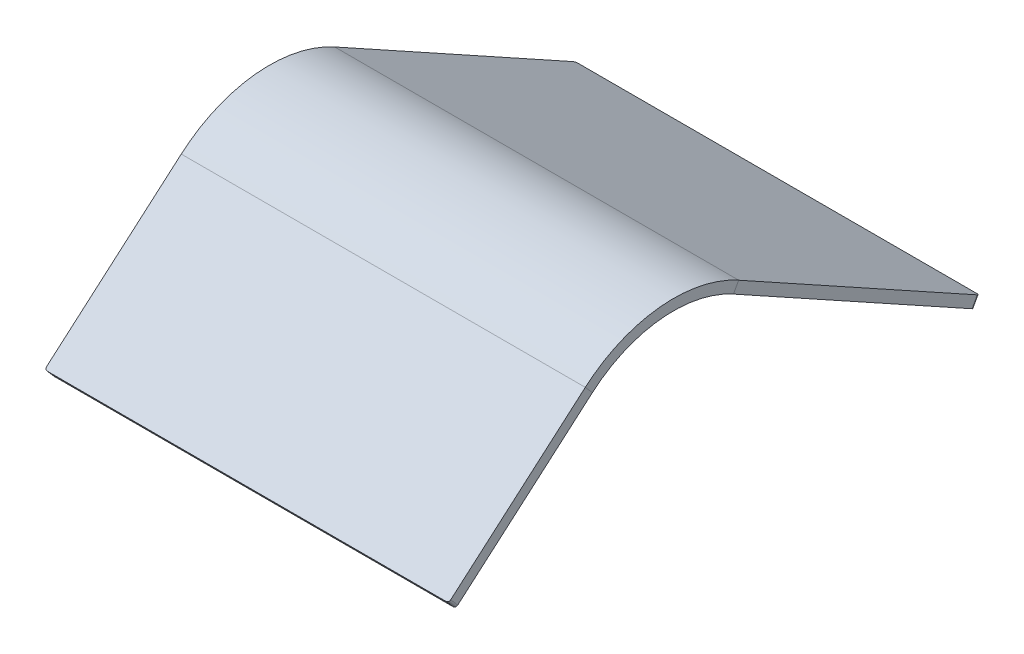
ISO-10303-21;
HEADER;
FILE_DESCRIPTION(('STEP AP214'),'2;1');
FILE_NAME('part.step','',(''),(''),'','','');
FILE_SCHEMA(('AUTOMOTIVE_DESIGN { 1 0 10303 214 1 1 1 1 }'));
ENDSEC;
DATA;
#1=APPLICATION_CONTEXT('core data for automotive mechanical design processes');
#2=APPLICATION_PROTOCOL_DEFINITION('international standard','automotive_design',2000,#1);
#3=PRODUCT_CONTEXT('',#1,'mechanical');
#4=PRODUCT('Part','Part','',(#3));
#5=PRODUCT_RELATED_PRODUCT_CATEGORY('part','',(#4));
#6=PRODUCT_DEFINITION_FORMATION('','',#4);
#7=PRODUCT_DEFINITION_CONTEXT('part definition',#1,'design');
#8=PRODUCT_DEFINITION('design','',#6,#7);
#9=PRODUCT_DEFINITION_SHAPE('','',#8);
#10=(LENGTH_UNIT() NAMED_UNIT(*) SI_UNIT(.MILLI.,.METRE.));
#11=(NAMED_UNIT(*) PLANE_ANGLE_UNIT() SI_UNIT($,.RADIAN.));
#12=(NAMED_UNIT(*) SI_UNIT($,.STERADIAN.) SOLID_ANGLE_UNIT());
#13=UNCERTAINTY_MEASURE_WITH_UNIT(LENGTH_MEASURE(1.E-05),#10,'distance_accuracy_value','');
#14=(GEOMETRIC_REPRESENTATION_CONTEXT(3) GLOBAL_UNCERTAINTY_ASSIGNED_CONTEXT((#13)) GLOBAL_UNIT_ASSIGNED_CONTEXT((#10,
#11,#12)) REPRESENTATION_CONTEXT('',''));
#15=CARTESIAN_POINT('',(0.,0.,0.));
#16=DIRECTION('',(0.,0.,1.));
#17=DIRECTION('',(1.,0.,0.));
#18=AXIS2_PLACEMENT_3D('',#15,#16,#17);
#19=CARTESIAN_POINT('',(150.,87.9153729006915,283.559185114587));
#20=DIRECTION('',(1.,0.,0.));
#21=DIRECTION('',(0.,0.,-1.));
#22=AXIS2_PLACEMENT_3D('',#19,#20,#21);
#23=PLANE('',#22);
#24=DIRECTION('',(0.,0.755689082789819,0.65493053841784));
#25=VECTOR('',#24,1.);
#26=CARTESIAN_POINT('',(150.,87.9153729006915,283.559185114587));
#27=LINE('',#26,#25);
#28=CARTESIAN_POINT('',(150.,87.9153729006915,283.559185114587));
#29=VERTEX_POINT('',#28);
#30=CARTESIAN_POINT('',(150.,93.96088556301,288.798629421929));
#31=VERTEX_POINT('',#30);
#32=EDGE_CURVE('E150',#29,#31,#27,.T.);
#33=ORIENTED_EDGE('',*,*,#32,.F.);
#34=CARTESIAN_POINT('',(150.,18.3919772840282,223.305575580145));
#35=DIRECTION('',(-1.,0.,0.));
#36=DIRECTION('',(0.,0.,1.));
#37=AXIS2_PLACEMENT_3D('',#34,#35,#36);
#38=CIRCLE('',#37,92.);
#39=CARTESIAN_POINT('',(150.,98.8951091864612,178.771928144757));
#40=VERTEX_POINT('',#39);
#41=EDGE_CURVE('E145',#29,#40,#38,.T.);
#42=ORIENTED_EDGE('',*,*,#41,.T.);
#43=DIRECTION('',(0.,-0.875034042417748,0.484061385167269));
#44=VECTOR('',#43,1.);
#45=CARTESIAN_POINT('',(150.,105.895381525803,174.899437063419));
#46=LINE('',#45,#44);
#47=CARTESIAN_POINT('',(150.,105.895381525803,174.899437063419));
#48=VERTEX_POINT('',#47);
#49=EDGE_CURVE('E139',#48,#40,#46,.T.);
#50=ORIENTED_EDGE('',*,*,#49,.F.);
#51=CARTESIAN_POINT('',(150.,18.3919772840282,223.305575580145));
#52=DIRECTION('',(1.,0.,0.));
#53=DIRECTION('',(0.,0.,-1.));
#54=AXIS2_PLACEMENT_3D('',#51,#52,#53);
#55=CIRCLE('',#54,100.);
#56=EDGE_CURVE('E143',#31,#48,#55,.F.);
#57=ORIENTED_EDGE('',*,*,#56,.F.);
#58=EDGE_LOOP('',(#33,#42,#50,#57));
#59=FACE_BOUND('',#58,.T.);
#60=ADVANCED_FACE('F49',(#59),#23,.T.);
#61=CARTESIAN_POINT('',(150.,105.895381525803,174.899437063419));
#62=DIRECTION('',(1.,0.,0.));
#63=DIRECTION('',(0.,0.,-1.));
#64=AXIS2_PLACEMENT_3D('',#61,#62,#63);
#65=PLANE('',#64);
#66=DIRECTION('',(0.,0.654930538417842,-0.755689082789818));
#67=VECTOR('',#66,1.);
#68=CARTESIAN_POINT('',(150.,6.04551266231849,390.239444307343));
#69=LINE('',#68,#67);
#70=CARTESIAN_POINT('',(150.,7.35537373915416,388.728066141763));
#71=VERTEX_POINT('',#70);
#72=EDGE_CURVE('E178',#71,#31,#69,.T.);
#73=ORIENTED_EDGE('',*,*,#72,.F.);
#74=DIRECTION('',(0.,0.755689082789817,0.654930538417843));
#75=VECTOR('',#74,1.);
#76=CARTESIAN_POINT('',(150.,-42.2006692006457,345.779495593936));
#77=LINE('',#76,#75);
#78=CARTESIAN_POINT('',(150.,1.30986107683562,383.48862183442));
#79=VERTEX_POINT('',#78);
#80=EDGE_CURVE('E13',#71,#79,#77,.F.);
#81=ORIENTED_EDGE('',*,*,#80,.T.);
#82=DIRECTION('',(0.,0.654930538417842,-0.755689082789818));
#83=VECTOR('',#82,1.);
#84=CARTESIAN_POINT('',(150.,0.,385.));
#85=LINE('',#84,#83);
#86=EDGE_CURVE('E180',#79,#29,#85,.T.);
#87=ORIENTED_EDGE('',*,*,#86,.T.);
#88=ORIENTED_EDGE('',*,*,#32,.T.);
#89=EDGE_LOOP('',(#73,#81,#87,#88));
#90=FACE_BOUND('',#89,.T.);
#91=ADVANCED_FACE('F268',(#90),#65,.T.);
#92=CARTESIAN_POINT('',(-150.,98.8951091864612,178.771928144757));
#93=DIRECTION('',(-1.,0.,0.));
#94=DIRECTION('',(0.,0.,1.));
#95=AXIS2_PLACEMENT_3D('',#92,#93,#94);
#96=PLANE('',#95);
#97=DIRECTION('',(0.,0.875034042417748,-0.484061385167269));
#98=VECTOR('',#97,1.);
#99=CARTESIAN_POINT('',(-150.,98.8951091864612,178.771928144757));
#100=LINE('',#99,#98);
#101=CARTESIAN_POINT('',(-150.,98.8951091864612,178.771928144757));
#102=VERTEX_POINT('',#101);
#103=CARTESIAN_POINT('',(-150.,105.895381525803,174.899437063419));
#104=VERTEX_POINT('',#103);
#105=EDGE_CURVE('E151',#102,#104,#100,.T.);
#106=ORIENTED_EDGE('',*,*,#105,.F.);
#107=CARTESIAN_POINT('',(-150.,18.3919772840282,223.305575580145));
#108=DIRECTION('',(-1.,0.,0.));
#109=DIRECTION('',(0.,0.,1.));
#110=AXIS2_PLACEMENT_3D('',#107,#108,#109);
#111=CIRCLE('',#110,92.);
#112=CARTESIAN_POINT('',(-150.,87.9153729006915,283.559185114587));
#113=VERTEX_POINT('',#112);
#114=EDGE_CURVE('E197',#113,#102,#111,.T.);
#115=ORIENTED_EDGE('',*,*,#114,.F.);
#116=DIRECTION('',(0.,-0.755689082789819,-0.65493053841784));
#117=VECTOR('',#116,1.);
#118=CARTESIAN_POINT('',(-150.,93.96088556301,288.798629421929));
#119=LINE('',#118,#117);
#120=CARTESIAN_POINT('',(-150.,93.96088556301,288.798629421929));
#121=VERTEX_POINT('',#120);
#122=EDGE_CURVE('E214',#121,#113,#119,.T.);
#123=ORIENTED_EDGE('',*,*,#122,.F.);
#124=CARTESIAN_POINT('',(-150.,18.3919772840282,223.305575580145));
#125=DIRECTION('',(1.,0.,0.));
#126=DIRECTION('',(0.,0.,-1.));
#127=AXIS2_PLACEMENT_3D('',#124,#125,#126);
#128=CIRCLE('',#127,100.);
#129=EDGE_CURVE('E191',#121,#104,#128,.F.);
#130=ORIENTED_EDGE('',*,*,#129,.T.);
#131=EDGE_LOOP('',(#106,#115,#123,#130));
#132=FACE_BOUND('',#131,.T.);
#133=ADVANCED_FACE('F291',(#132),#96,.T.);
#134=CARTESIAN_POINT('',(-150.,93.96088556301,288.798629421929));
#135=DIRECTION('',(-1.,0.,0.));
#136=DIRECTION('',(0.,0.,1.));
#137=AXIS2_PLACEMENT_3D('',#134,#135,#136);
#138=PLANE('',#137);
#139=DIRECTION('',(0.,-0.484061385167266,-0.87503404241775));
#140=VECTOR('',#139,1.);
#141=CARTESIAN_POINT('',(-150.,137.000272339342,231.127508918662));
#142=LINE('',#141,#140);
#143=CARTESIAN_POINT('',(-150.,7.96839510967642,-2.12242299650284));
#144=VERTEX_POINT('',#143);
#145=EDGE_CURVE('E163',#104,#144,#142,.T.);
#146=ORIENTED_EDGE('',*,*,#145,.T.);
#147=DIRECTION('',(0.,-0.875034042417742,0.48406138516728));
#148=VECTOR('',#147,1.);
#149=CARTESIAN_POINT('',(-150.,-49.4139669852702,29.6210113538945));
#150=LINE('',#149,#148);
#151=CARTESIAN_POINT('',(-150.,0.968122770334534,1.75006808483549));
#152=VERTEX_POINT('',#151);
#153=EDGE_CURVE('E220',#144,#152,#150,.T.);
#154=ORIENTED_EDGE('',*,*,#153,.T.);
#155=DIRECTION('',(0.,-0.484061385167266,-0.87503404241775));
#156=VECTOR('',#155,1.);
#157=CARTESIAN_POINT('',(-150.,130.,235.));
#158=LINE('',#157,#156);
#159=EDGE_CURVE('E187',#102,#152,#158,.T.);
#160=ORIENTED_EDGE('',*,*,#159,.F.);
#161=ORIENTED_EDGE('',*,*,#105,.T.);
#162=EDGE_LOOP('',(#146,#154,#160,#161));
#163=FACE_BOUND('',#162,.T.);
#164=ADVANCED_FACE('F289',(#163),#138,.T.);
#165=CARTESIAN_POINT('',(150.,130.,235.));
#166=DIRECTION('',(0.,0.87503404241775,-0.484061385167266));
#167=DIRECTION('',(0.,0.484061385167266,0.87503404241775));
#168=AXIS2_PLACEMENT_3D('',#165,#166,#167);
#169=PLANE('',#168);
#170=ORIENTED_EDGE('',*,*,#159,.T.);
#171=CARTESIAN_POINT('',(-148.,0.968122770334506,1.75006808483549));
#172=DIRECTION('',(0.,0.87503404241775,-0.484061385167266));
#173=DIRECTION('',(0.,0.484061385167266,0.87503404241775));
#174=AXIS2_PLACEMENT_3D('',#171,#172,#173);
#175=CIRCLE('',#174,2.);
#176=CARTESIAN_POINT('',(-148.,0.,0.));
#177=VERTEX_POINT('',#176);
#178=EDGE_CURVE('E225',#152,#177,#175,.F.);
#179=ORIENTED_EDGE('',*,*,#178,.T.);
#180=DIRECTION('',(-1.,0.,0.));
#181=VECTOR('',#180,1.);
#182=CARTESIAN_POINT('',(150.,0.,0.));
#183=LINE('',#182,#181);
#184=CARTESIAN_POINT('',(148.,0.,0.));
#185=VERTEX_POINT('',#184);
#186=EDGE_CURVE('E211',#185,#177,#183,.T.);
#187=ORIENTED_EDGE('',*,*,#186,.F.);
#188=CARTESIAN_POINT('',(148.,0.96812277033453,1.7500680848355));
#189=DIRECTION('',(0.,0.87503404241775,-0.484061385167266));
#190=DIRECTION('',(0.,0.484061385167266,0.87503404241775));
#191=AXIS2_PLACEMENT_3D('',#188,#189,#190);
#192=CIRCLE('',#191,2.);
#193=CARTESIAN_POINT('',(150.,0.968122770334562,1.75006808483555));
#194=VERTEX_POINT('',#193);
#195=EDGE_CURVE('E223',#185,#194,#192,.F.);
#196=ORIENTED_EDGE('',*,*,#195,.T.);
#197=DIRECTION('',(0.,-0.484061385167266,-0.87503404241775));
#198=VECTOR('',#197,1.);
#199=CARTESIAN_POINT('',(150.,130.,235.));
#200=LINE('',#199,#198);
#201=EDGE_CURVE('E173',#40,#194,#200,.T.);
#202=ORIENTED_EDGE('',*,*,#201,.F.);
#203=DIRECTION('',(-1.,0.,0.));
#204=VECTOR('',#203,1.);
#205=CARTESIAN_POINT('',(150.,98.8951091864612,178.771928144757));
#206=LINE('',#205,#204);
#207=EDGE_CURVE('E186',#40,#102,#206,.T.);
#208=ORIENTED_EDGE('',*,*,#207,.T.);
#209=EDGE_LOOP('',(#170,#179,#187,#196,#202,#208));
#210=FACE_BOUND('',#209,.T.);
#211=ADVANCED_FACE('F275',(#210),#169,.F.);
#212=CARTESIAN_POINT('',(150.,7.00027233934195,-3.87249108133825));
#213=DIRECTION('',(0.,-0.48406138516728,-0.875034042417742));
#214=DIRECTION('',(0.,0.875034042417742,-0.48406138516728));
#215=AXIS2_PLACEMENT_3D('',#212,#213,#214);
#216=PLANE('',#215);
#217=ORIENTED_EDGE('',*,*,#186,.T.);
#218=DIRECTION('',(0.,-0.875034042417742,0.48406138516728));
#219=VECTOR('',#218,1.);
#220=CARTESIAN_POINT('',(-148.,7.00027233934195,-3.87249108133825));
#221=LINE('',#220,#219);
#222=CARTESIAN_POINT('',(-148.,7.00027233934195,-3.87249108133825));
#223=VERTEX_POINT('',#222);
#224=EDGE_CURVE('E230',#177,#223,#221,.F.);
#225=ORIENTED_EDGE('',*,*,#224,.T.);
#226=DIRECTION('',(-1.,0.,0.));
#227=VECTOR('',#226,1.);
#228=CARTESIAN_POINT('',(150.,7.00027233934195,-3.87249108133825));
#229=LINE('',#228,#227);
#230=CARTESIAN_POINT('',(148.,7.00027233934195,-3.87249108133825));
#231=VERTEX_POINT('',#230);
#232=EDGE_CURVE('E167',#231,#223,#229,.T.);
#233=ORIENTED_EDGE('',*,*,#232,.F.);
#234=DIRECTION('',(0.,-0.875034042417742,0.48406138516728));
#235=VECTOR('',#234,1.);
#236=CARTESIAN_POINT('',(148.,7.00027233934195,-3.87249108133825));
#237=LINE('',#236,#235);
#238=EDGE_CURVE('E227',#231,#185,#237,.T.);
#239=ORIENTED_EDGE('',*,*,#238,.T.);
#240=EDGE_LOOP('',(#217,#225,#233,#239));
#241=FACE_BOUND('',#240,.T.);
#242=ADVANCED_FACE('F283',(#241),#216,.T.);
#243=CARTESIAN_POINT('',(150.,137.000272339342,231.127508918662));
#244=DIRECTION('',(0.,0.87503404241775,-0.484061385167266));
#245=DIRECTION('',(0.,0.484061385167266,0.87503404241775));
#246=AXIS2_PLACEMENT_3D('',#243,#244,#245);
#247=PLANE('',#246);
#248=ORIENTED_EDGE('',*,*,#232,.T.);
#249=CARTESIAN_POINT('',(-148.,7.96839510967648,-2.12242299650277));
#250=DIRECTION('',(0.,0.87503404241775,-0.484061385167266));
#251=DIRECTION('',(0.,0.484061385167266,0.87503404241775));
#252=AXIS2_PLACEMENT_3D('',#249,#250,#251);
#253=CIRCLE('',#252,2.);
#254=EDGE_CURVE('E234',#223,#144,#253,.T.);
#255=ORIENTED_EDGE('',*,*,#254,.T.);
#256=ORIENTED_EDGE('',*,*,#145,.F.);
#257=DIRECTION('',(-1.,0.,0.));
#258=VECTOR('',#257,1.);
#259=CARTESIAN_POINT('',(150.,105.895381525803,174.899437063419));
#260=LINE('',#259,#258);
#261=EDGE_CURVE('E157',#48,#104,#260,.T.);
#262=ORIENTED_EDGE('',*,*,#261,.F.);
#263=DIRECTION('',(0.,-0.484061385167266,-0.87503404241775));
#264=VECTOR('',#263,1.);
#265=CARTESIAN_POINT('',(150.,137.000272339342,231.127508918662));
#266=LINE('',#265,#264);
#267=CARTESIAN_POINT('',(150.,7.96839510967642,-2.12242299650284));
#268=VERTEX_POINT('',#267);
#269=EDGE_CURVE('E160',#48,#268,#266,.T.);
#270=ORIENTED_EDGE('',*,*,#269,.T.);
#271=CARTESIAN_POINT('',(148.,7.96839510967648,-2.12242299650275));
#272=DIRECTION('',(0.,0.87503404241775,-0.484061385167266));
#273=DIRECTION('',(0.,0.484061385167266,0.87503404241775));
#274=AXIS2_PLACEMENT_3D('',#271,#272,#273);
#275=CIRCLE('',#274,2.);
#276=EDGE_CURVE('E232',#268,#231,#275,.T.);
#277=ORIENTED_EDGE('',*,*,#276,.T.);
#278=EDGE_LOOP('',(#248,#255,#256,#262,#270,#277));
#279=FACE_BOUND('',#278,.T.);
#280=ADVANCED_FACE('F159',(#279),#247,.T.);
#281=CARTESIAN_POINT('',(150.,18.3919772840282,223.305575580145));
#282=DIRECTION('',(-1.,0.,0.));
#283=DIRECTION('',(0.,0.,1.));
#284=AXIS2_PLACEMENT_3D('',#281,#282,#283);
#285=CYLINDRICAL_SURFACE('',#284,100.);
#286=ORIENTED_EDGE('',*,*,#129,.F.);
#287=DIRECTION('',(-1.,0.,0.));
#288=VECTOR('',#287,1.);
#289=CARTESIAN_POINT('',(150.,93.96088556301,288.798629421929));
#290=LINE('',#289,#288);
#291=EDGE_CURVE('E168',#31,#121,#290,.T.);
#292=ORIENTED_EDGE('',*,*,#291,.F.);
#293=ORIENTED_EDGE('',*,*,#56,.T.);
#294=ORIENTED_EDGE('',*,*,#261,.T.);
#295=EDGE_LOOP('',(#286,#292,#293,#294));
#296=FACE_BOUND('',#295,.T.);
#297=ADVANCED_FACE('F176',(#296),#285,.T.);
#298=CARTESIAN_POINT('',(150.,6.04551266231849,390.239444307343));
#299=DIRECTION('',(0.,0.755689082789817,0.654930538417842));
#300=DIRECTION('',(0.,-0.654930538417842,0.755689082789817));
#301=AXIS2_PLACEMENT_3D('',#298,#299,#300);
#302=PLANE('',#301);
#303=DIRECTION('',(0.,0.654930538417842,-0.755689082789818));
#304=VECTOR('',#303,1.);
#305=CARTESIAN_POINT('',(-150.,6.04551266231849,390.239444307343));
#306=LINE('',#305,#304);
#307=CARTESIAN_POINT('',(-150.,7.35537373915416,388.728066141763));
#308=VERTEX_POINT('',#307);
#309=EDGE_CURVE('E193',#308,#121,#306,.T.);
#310=ORIENTED_EDGE('',*,*,#309,.F.);
#311=CARTESIAN_POINT('',(-148.,7.35537373915417,388.728066141763));
#312=DIRECTION('',(0.,0.755689082789817,0.654930538417842));
#313=DIRECTION('',(0.,-0.654930538417842,0.755689082789817));
#314=AXIS2_PLACEMENT_3D('',#311,#312,#313);
#315=CIRCLE('',#314,2.);
#316=CARTESIAN_POINT('',(-148.,6.04551266231849,390.239444307343));
#317=VERTEX_POINT('',#316);
#318=EDGE_CURVE('E242',#308,#317,#315,.T.);
#319=ORIENTED_EDGE('',*,*,#318,.T.);
#320=DIRECTION('',(-1.,0.,0.));
#321=VECTOR('',#320,1.);
#322=CARTESIAN_POINT('',(150.,6.04551266231849,390.239444307343));
#323=LINE('',#322,#321);
#324=CARTESIAN_POINT('',(148.,6.04551266231849,390.239444307343));
#325=VERTEX_POINT('',#324);
#326=EDGE_CURVE('E207',#325,#317,#323,.T.);
#327=ORIENTED_EDGE('',*,*,#326,.F.);
#328=CARTESIAN_POINT('',(148.,7.35537373915417,388.728066141763));
#329=DIRECTION('',(0.,0.755689082789817,0.654930538417842));
#330=DIRECTION('',(0.,-0.654930538417842,0.755689082789817));
#331=AXIS2_PLACEMENT_3D('',#328,#329,#330);
#332=CIRCLE('',#331,2.);
#333=EDGE_CURVE('E240',#325,#71,#332,.T.);
#334=ORIENTED_EDGE('',*,*,#333,.T.);
#335=ORIENTED_EDGE('',*,*,#72,.T.);
#336=ORIENTED_EDGE('',*,*,#291,.T.);
#337=EDGE_LOOP('',(#310,#319,#327,#334,#335,#336));
#338=FACE_BOUND('',#337,.T.);
#339=ADVANCED_FACE('F263',(#338),#302,.T.);
#340=CARTESIAN_POINT('',(150.,0.,385.));
#341=DIRECTION('',(0.,-0.654930538417843,0.755689082789817));
#342=DIRECTION('',(0.,-0.755689082789817,-0.654930538417843));
#343=AXIS2_PLACEMENT_3D('',#340,#341,#342);
#344=PLANE('',#343);
#345=ORIENTED_EDGE('',*,*,#326,.T.);
#346=DIRECTION('',(0.,0.755689082789817,0.654930538417843));
#347=VECTOR('',#346,1.);
#348=CARTESIAN_POINT('',(-148.,0.,385.));
#349=LINE('',#348,#347);
#350=CARTESIAN_POINT('',(-148.,0.,385.));
#351=VERTEX_POINT('',#350);
#352=EDGE_CURVE('E70',#317,#351,#349,.F.);
#353=ORIENTED_EDGE('',*,*,#352,.T.);
#354=DIRECTION('',(-1.,0.,0.));
#355=VECTOR('',#354,1.);
#356=CARTESIAN_POINT('',(150.,0.,385.));
#357=LINE('',#356,#355);
#358=CARTESIAN_POINT('',(148.,0.,385.));
#359=VERTEX_POINT('',#358);
#360=EDGE_CURVE('E205',#359,#351,#357,.T.);
#361=ORIENTED_EDGE('',*,*,#360,.F.);
#362=DIRECTION('',(0.,0.755689082789817,0.654930538417843));
#363=VECTOR('',#362,1.);
#364=CARTESIAN_POINT('',(148.,0.,385.));
#365=LINE('',#364,#363);
#366=EDGE_CURVE('E244',#359,#325,#365,.T.);
#367=ORIENTED_EDGE('',*,*,#366,.T.);
#368=EDGE_LOOP('',(#345,#353,#361,#367));
#369=FACE_BOUND('',#368,.T.);
#370=ADVANCED_FACE('F264',(#369),#344,.T.);
#371=CARTESIAN_POINT('',(150.,0.,385.));
#372=DIRECTION('',(0.,0.755689082789817,0.654930538417842));
#373=DIRECTION('',(0.,-0.654930538417842,0.755689082789817));
#374=AXIS2_PLACEMENT_3D('',#371,#372,#373);
#375=PLANE('',#374);
#376=ORIENTED_EDGE('',*,*,#360,.T.);
#377=CARTESIAN_POINT('',(-148.,1.30986107683562,383.48862183442));
#378=DIRECTION('',(0.,0.755689082789817,0.654930538417842));
#379=DIRECTION('',(0.,-0.654930538417842,0.755689082789817));
#380=AXIS2_PLACEMENT_3D('',#377,#378,#379);
#381=CIRCLE('',#380,2.);
#382=CARTESIAN_POINT('',(-150.,1.30986107683562,383.48862183442));
#383=VERTEX_POINT('',#382);
#384=EDGE_CURVE('E57',#351,#383,#381,.F.);
#385=ORIENTED_EDGE('',*,*,#384,.T.);
#386=DIRECTION('',(0.,0.654930538417842,-0.755689082789818));
#387=VECTOR('',#386,1.);
#388=CARTESIAN_POINT('',(-150.,0.,385.));
#389=LINE('',#388,#387);
#390=EDGE_CURVE('E195',#383,#113,#389,.T.);
#391=ORIENTED_EDGE('',*,*,#390,.T.);
#392=DIRECTION('',(-1.,0.,0.));
#393=VECTOR('',#392,1.);
#394=CARTESIAN_POINT('',(150.,87.9153729006915,283.559185114587));
#395=LINE('',#394,#393);
#396=EDGE_CURVE('E202',#29,#113,#395,.T.);
#397=ORIENTED_EDGE('',*,*,#396,.F.);
#398=ORIENTED_EDGE('',*,*,#86,.F.);
#399=CARTESIAN_POINT('',(148.,1.30986107683563,383.48862183442));
#400=DIRECTION('',(0.,0.755689082789817,0.654930538417842));
#401=DIRECTION('',(0.,-0.654930538417842,0.755689082789817));
#402=AXIS2_PLACEMENT_3D('',#399,#400,#401);
#403=CIRCLE('',#402,2.);
#404=EDGE_CURVE('E248',#79,#359,#403,.F.);
#405=ORIENTED_EDGE('',*,*,#404,.T.);
#406=EDGE_LOOP('',(#376,#385,#391,#397,#398,#405));
#407=FACE_BOUND('',#406,.T.);
#408=ADVANCED_FACE('F252',(#407),#375,.F.);
#409=CARTESIAN_POINT('',(150.,18.3919772840282,223.305575580145));
#410=DIRECTION('',(-1.,0.,0.));
#411=DIRECTION('',(0.,0.,1.));
#412=AXIS2_PLACEMENT_3D('',#409,#410,#411);
#413=CYLINDRICAL_SURFACE('',#412,92.);
#414=ORIENTED_EDGE('',*,*,#114,.T.);
#415=ORIENTED_EDGE('',*,*,#207,.F.);
#416=ORIENTED_EDGE('',*,*,#41,.F.);
#417=ORIENTED_EDGE('',*,*,#396,.T.);
#418=EDGE_LOOP('',(#414,#415,#416,#417));
#419=FACE_BOUND('',#418,.T.);
#420=ADVANCED_FACE('F271',(#419),#413,.F.);
#421=CARTESIAN_POINT('',(150.,18.3919772840282,223.305575580145));
#422=DIRECTION('',(1.,0.,0.));
#423=DIRECTION('',(0.,0.,-1.));
#424=AXIS2_PLACEMENT_3D('',#421,#422,#423);
#425=PLANE('',#424);
#426=ORIENTED_EDGE('',*,*,#201,.T.);
#427=DIRECTION('',(0.,-0.875034042417742,0.48406138516728));
#428=VECTOR('',#427,1.);
#429=CARTESIAN_POINT('',(150.,-79.5350091321006,46.2837155202269));
#430=LINE('',#429,#428);
#431=EDGE_CURVE('E172',#194,#268,#430,.F.);
#432=ORIENTED_EDGE('',*,*,#431,.T.);
#433=ORIENTED_EDGE('',*,*,#269,.F.);
#434=ORIENTED_EDGE('',*,*,#49,.T.);
#435=EDGE_LOOP('',(#426,#432,#433,#434));
#436=FACE_BOUND('',#435,.T.);
#437=ADVANCED_FACE('F170',(#436),#425,.T.);
#438=CARTESIAN_POINT('',(-150.,18.3919772840282,223.305575580145));
#439=DIRECTION('',(1.,0.,0.));
#440=DIRECTION('',(0.,0.,-1.));
#441=AXIS2_PLACEMENT_3D('',#438,#439,#440);
#442=PLANE('',#441);
#443=ORIENTED_EDGE('',*,*,#390,.F.);
#444=DIRECTION('',(0.,0.755689082789817,0.654930538417843));
#445=VECTOR('',#444,1.);
#446=CARTESIAN_POINT('',(-150.,7.35537373915417,388.728066141763));
#447=LINE('',#446,#445);
#448=EDGE_CURVE('E237',#383,#308,#447,.T.);
#449=ORIENTED_EDGE('',*,*,#448,.T.);
#450=ORIENTED_EDGE('',*,*,#309,.T.);
#451=ORIENTED_EDGE('',*,*,#122,.T.);
#452=EDGE_LOOP('',(#443,#449,#450,#451));
#453=FACE_BOUND('',#452,.T.);
#454=ADVANCED_FACE('F257',(#453),#442,.F.);
#455=CARTESIAN_POINT('',(-148.,-49.4139669852702,29.6210113538945));
#456=DIRECTION('',(0.,-0.875034042417742,0.48406138516728));
#457=DIRECTION('',(0.,-0.48406138516728,-0.875034042417742));
#458=AXIS2_PLACEMENT_3D('',#455,#456,#457);
#459=CYLINDRICAL_SURFACE('',#458,2.);
#460=ORIENTED_EDGE('',*,*,#254,.F.);
#461=ORIENTED_EDGE('',*,*,#224,.F.);
#462=ORIENTED_EDGE('',*,*,#178,.F.);
#463=ORIENTED_EDGE('',*,*,#153,.F.);
#464=EDGE_LOOP('',(#460,#461,#462,#463));
#465=FACE_BOUND('',#464,.T.);
#466=ADVANCED_FACE('F286',(#465),#459,.T.);
#467=CARTESIAN_POINT('',(148.,7.96839510967651,-2.12242299650276));
#468=DIRECTION('',(0.,-0.875034042417742,0.48406138516728));
#469=DIRECTION('',(0.,-0.48406138516728,-0.875034042417742));
#470=AXIS2_PLACEMENT_3D('',#467,#468,#469);
#471=CYLINDRICAL_SURFACE('',#470,2.);
#472=ORIENTED_EDGE('',*,*,#276,.F.);
#473=ORIENTED_EDGE('',*,*,#431,.F.);
#474=ORIENTED_EDGE('',*,*,#195,.F.);
#475=ORIENTED_EDGE('',*,*,#238,.F.);
#476=EDGE_LOOP('',(#472,#473,#474,#475));
#477=FACE_BOUND('',#476,.T.);
#478=ADVANCED_FACE('F278',(#477),#471,.T.);
#479=CARTESIAN_POINT('',(-148.,-68.2135345398276,323.235012299979));
#480=DIRECTION('',(0.,-0.755689082789817,-0.654930538417843));
#481=DIRECTION('',(0.,0.654930538417843,-0.755689082789817));
#482=AXIS2_PLACEMENT_3D('',#479,#480,#481);
#483=CYLINDRICAL_SURFACE('',#482,2.);
#484=ORIENTED_EDGE('',*,*,#384,.F.);
#485=ORIENTED_EDGE('',*,*,#352,.F.);
#486=ORIENTED_EDGE('',*,*,#318,.F.);
#487=ORIENTED_EDGE('',*,*,#448,.F.);
#488=EDGE_LOOP('',(#484,#485,#486,#487));
#489=FACE_BOUND('',#488,.T.);
#490=ADVANCED_FACE('F260',(#489),#483,.T.);
#491=CARTESIAN_POINT('',(148.,1.30986107683564,383.48862183442));
#492=DIRECTION('',(0.,0.755689082789817,0.654930538417843));
#493=DIRECTION('',(0.,-0.654930538417843,0.755689082789817));
#494=AXIS2_PLACEMENT_3D('',#491,#492,#493);
#495=CYLINDRICAL_SURFACE('',#494,2.);
#496=ORIENTED_EDGE('',*,*,#404,.F.);
#497=ORIENTED_EDGE('',*,*,#80,.F.);
#498=ORIENTED_EDGE('',*,*,#333,.F.);
#499=ORIENTED_EDGE('',*,*,#366,.F.);
#500=EDGE_LOOP('',(#496,#497,#498,#499));
#501=FACE_BOUND('',#500,.T.);
#502=ADVANCED_FACE('F51',(#501),#495,.T.);
#503=CLOSED_SHELL('',(#60,#91,#133,#164,#211,#242,#280,#297,#339,#370,#408,#420,#437,#454,#466,
#478,#490,#502));
#504=MANIFOLD_SOLID_BREP('B2',#503);
#505=ADVANCED_BREP_SHAPE_REPRESENTATION('',(#18,#504),#14);
#506=SHAPE_DEFINITION_REPRESENTATION(#9,#505);
ENDSEC;
END-ISO-10303-21;
